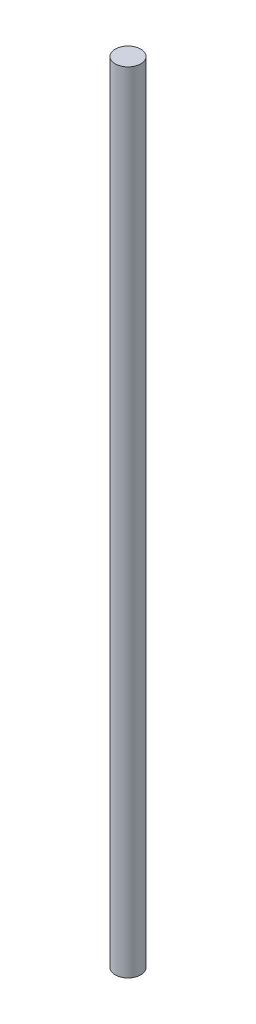
ISO-10303-21;
HEADER;
FILE_DESCRIPTION(('STEP AP214'),'2;1');
FILE_NAME('part.step','',(''),(''),'','','');
FILE_SCHEMA(('AUTOMOTIVE_DESIGN { 1 0 10303 214 1 1 1 1 }'));
ENDSEC;
DATA;
#1=APPLICATION_CONTEXT('core data for automotive mechanical design processes');
#2=APPLICATION_PROTOCOL_DEFINITION('international standard','automotive_design',2000,#1);
#3=PRODUCT_CONTEXT('',#1,'mechanical');
#4=PRODUCT('Part','Part','',(#3));
#5=PRODUCT_RELATED_PRODUCT_CATEGORY('part','',(#4));
#6=PRODUCT_DEFINITION_FORMATION('','',#4);
#7=PRODUCT_DEFINITION_CONTEXT('part definition',#1,'design');
#8=PRODUCT_DEFINITION('design','',#6,#7);
#9=PRODUCT_DEFINITION_SHAPE('','',#8);
#10=(LENGTH_UNIT() NAMED_UNIT(*) SI_UNIT(.MILLI.,.METRE.));
#11=(NAMED_UNIT(*) PLANE_ANGLE_UNIT() SI_UNIT($,.RADIAN.));
#12=(NAMED_UNIT(*) SI_UNIT($,.STERADIAN.) SOLID_ANGLE_UNIT());
#13=UNCERTAINTY_MEASURE_WITH_UNIT(LENGTH_MEASURE(1.E-05),#10,'distance_accuracy_value','');
#14=(GEOMETRIC_REPRESENTATION_CONTEXT(3) GLOBAL_UNCERTAINTY_ASSIGNED_CONTEXT((#13)) GLOBAL_UNIT_ASSIGNED_CONTEXT((#10,
#11,#12)) REPRESENTATION_CONTEXT('',''));
#15=CARTESIAN_POINT('',(0.,0.,0.));
#16=DIRECTION('',(0.,0.,1.));
#17=DIRECTION('',(1.,0.,0.));
#18=AXIS2_PLACEMENT_3D('',#15,#16,#17);
#19=CARTESIAN_POINT('',(0.,370.,0.));
#20=DIRECTION('',(0.,-1.,0.));
#21=DIRECTION('',(0.,0.,-1.));
#22=AXIS2_PLACEMENT_3D('',#19,#20,#21);
#23=CYLINDRICAL_SURFACE('',#22,6.);
#24=CARTESIAN_POINT('',(0.,370.,0.));
#25=DIRECTION('',(0.,1.,0.));
#26=DIRECTION('',(0.,0.,1.));
#27=AXIS2_PLACEMENT_3D('',#24,#25,#26);
#28=CIRCLE('',#27,6.);
#29=CARTESIAN_POINT('',(0.,370.,6.));
#30=VERTEX_POINT('',#29);
#31=EDGE_CURVE('E10',#30,#30,#28,.T.);
#32=ORIENTED_EDGE('',*,*,#31,.F.);
#33=EDGE_LOOP('',(#32));
#34=FACE_BOUND('',#33,.T.);
#35=CARTESIAN_POINT('',(0.,0.,0.));
#36=DIRECTION('',(0.,1.,0.));
#37=DIRECTION('',(0.,0.,1.));
#38=AXIS2_PLACEMENT_3D('',#35,#36,#37);
#39=CIRCLE('',#38,6.);
#40=CARTESIAN_POINT('',(0.,0.,6.));
#41=VERTEX_POINT('',#40);
#42=EDGE_CURVE('E40',#41,#41,#39,.T.);
#43=ORIENTED_EDGE('',*,*,#42,.T.);
#44=EDGE_LOOP('',(#43));
#45=FACE_BOUND('',#44,.T.);
#46=ADVANCED_FACE('F37',(#34,#45),#23,.T.);
#47=CARTESIAN_POINT('',(0.,370.,0.));
#48=DIRECTION('',(0.,1.,0.));
#49=DIRECTION('',(0.,0.,1.));
#50=AXIS2_PLACEMENT_3D('',#47,#48,#49);
#51=PLANE('',#50);
#52=ORIENTED_EDGE('',*,*,#31,.T.);
#53=EDGE_LOOP('',(#52));
#54=FACE_BOUND('',#53,.T.);
#55=ADVANCED_FACE('F52',(#54),#51,.T.);
#56=CARTESIAN_POINT('',(0.,0.,0.));
#57=DIRECTION('',(0.,1.,0.));
#58=DIRECTION('',(0.,0.,1.));
#59=AXIS2_PLACEMENT_3D('',#56,#57,#58);
#60=PLANE('',#59);
#61=ORIENTED_EDGE('',*,*,#42,.F.);
#62=EDGE_LOOP('',(#61));
#63=FACE_BOUND('',#62,.T.);
#64=ADVANCED_FACE('F50',(#63),#60,.F.);
#65=CLOSED_SHELL('',(#46,#55,#64));
#66=MANIFOLD_SOLID_BREP('B2',#65);
#67=ADVANCED_BREP_SHAPE_REPRESENTATION('',(#18,#66),#14);
#68=SHAPE_DEFINITION_REPRESENTATION(#9,#67);
ENDSEC;
END-ISO-10303-21;
